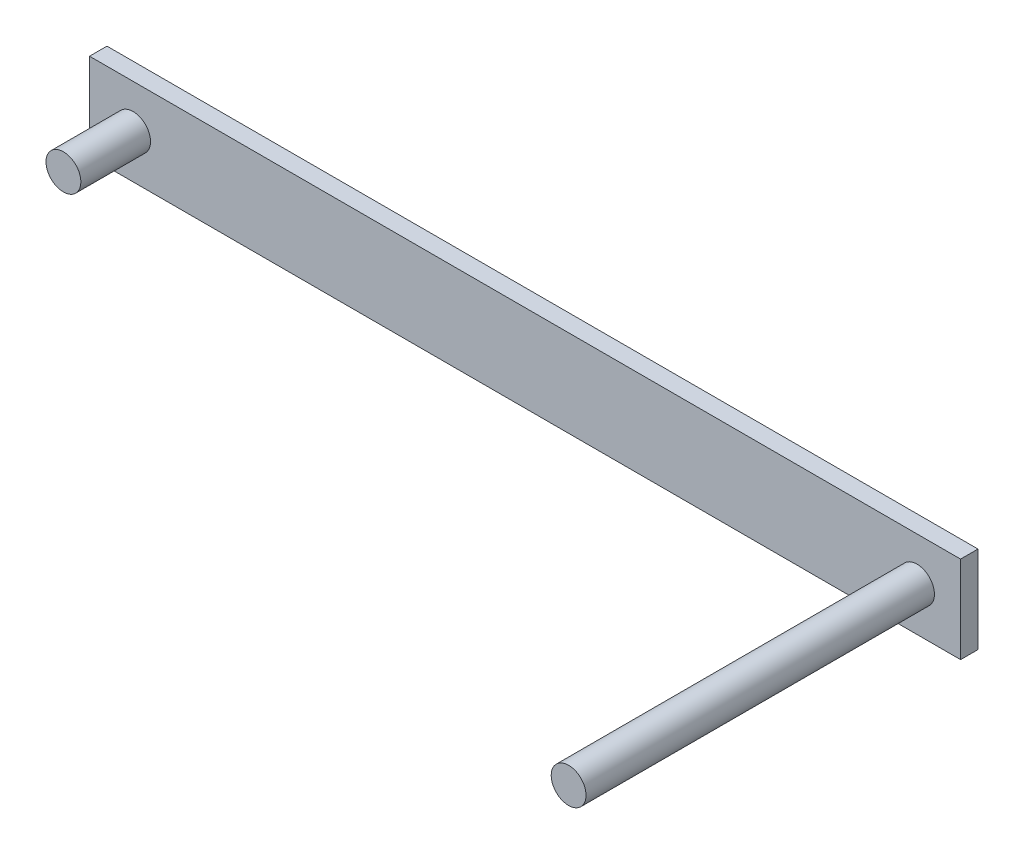
ISO-10303-21;
HEADER;
FILE_DESCRIPTION(('STEP AP214'),'2;1');
FILE_NAME('part.step','',(''),(''),'','','');
FILE_SCHEMA(('AUTOMOTIVE_DESIGN { 1 0 10303 214 1 1 1 1 }'));
ENDSEC;
DATA;
#1=APPLICATION_CONTEXT('core data for automotive mechanical design processes');
#2=APPLICATION_PROTOCOL_DEFINITION('international standard','automotive_design',2000,#1);
#3=PRODUCT_CONTEXT('',#1,'mechanical');
#4=PRODUCT('Part','Part','',(#3));
#5=PRODUCT_RELATED_PRODUCT_CATEGORY('part','',(#4));
#6=PRODUCT_DEFINITION_FORMATION('','',#4);
#7=PRODUCT_DEFINITION_CONTEXT('part definition',#1,'design');
#8=PRODUCT_DEFINITION('design','',#6,#7);
#9=PRODUCT_DEFINITION_SHAPE('','',#8);
#10=(LENGTH_UNIT() NAMED_UNIT(*) SI_UNIT(.MILLI.,.METRE.));
#11=(NAMED_UNIT(*) PLANE_ANGLE_UNIT() SI_UNIT($,.RADIAN.));
#12=(NAMED_UNIT(*) SI_UNIT($,.STERADIAN.) SOLID_ANGLE_UNIT());
#13=UNCERTAINTY_MEASURE_WITH_UNIT(LENGTH_MEASURE(1.E-05),#10,'distance_accuracy_value','');
#14=(GEOMETRIC_REPRESENTATION_CONTEXT(3) GLOBAL_UNCERTAINTY_ASSIGNED_CONTEXT((#13)) GLOBAL_UNIT_ASSIGNED_CONTEXT((#10,
#11,#12)) REPRESENTATION_CONTEXT('',''));
#15=CARTESIAN_POINT('',(0.,0.,0.));
#16=DIRECTION('',(0.,0.,1.));
#17=DIRECTION('',(1.,0.,0.));
#18=AXIS2_PLACEMENT_3D('',#15,#16,#17);
#19=CARTESIAN_POINT('',(0.,50.,10.));
#20=DIRECTION('',(0.,0.,-1.));
#21=DIRECTION('',(-1.,0.,0.));
#22=AXIS2_PLACEMENT_3D('',#19,#20,#21);
#23=PLANE('',#22);
#24=CARTESIAN_POINT('',(25.,25.,10.));
#25=DIRECTION('',(0.,0.,-1.));
#26=DIRECTION('',(-1.,0.,0.));
#27=AXIS2_PLACEMENT_3D('',#24,#25,#26);
#28=CIRCLE('',#27,10.);
#29=CARTESIAN_POINT('',(15.,25.,10.));
#30=VERTEX_POINT('',#29);
#31=EDGE_CURVE('E25',#30,#30,#28,.F.);
#32=ORIENTED_EDGE('',*,*,#31,.F.);
#33=EDGE_LOOP('',(#32));
#34=FACE_BOUND('',#33,.T.);
#35=DIRECTION('',(0.,-1.,0.));
#36=VECTOR('',#35,1.);
#37=CARTESIAN_POINT('',(0.,0.,10.));
#38=LINE('',#37,#36);
#39=CARTESIAN_POINT('',(0.,50.,10.));
#40=VERTEX_POINT('',#39);
#41=CARTESIAN_POINT('',(0.,0.,10.));
#42=VERTEX_POINT('',#41);
#43=EDGE_CURVE('E69',#40,#42,#38,.T.);
#44=ORIENTED_EDGE('',*,*,#43,.T.);
#45=DIRECTION('',(1.,0.,0.));
#46=VECTOR('',#45,1.);
#47=CARTESIAN_POINT('',(0.,0.,10.));
#48=LINE('',#47,#46);
#49=CARTESIAN_POINT('',(500.,0.,10.));
#50=VERTEX_POINT('',#49);
#51=EDGE_CURVE('E64',#42,#50,#48,.T.);
#52=ORIENTED_EDGE('',*,*,#51,.T.);
#53=DIRECTION('',(0.,1.,0.));
#54=VECTOR('',#53,1.);
#55=CARTESIAN_POINT('',(500.,0.,10.));
#56=LINE('',#55,#54);
#57=CARTESIAN_POINT('',(500.,50.,10.));
#58=VERTEX_POINT('',#57);
#59=EDGE_CURVE('E67',#50,#58,#56,.T.);
#60=ORIENTED_EDGE('',*,*,#59,.T.);
#61=DIRECTION('',(-1.,0.,0.));
#62=VECTOR('',#61,1.);
#63=CARTESIAN_POINT('',(0.,50.,10.));
#64=LINE('',#63,#62);
#65=EDGE_CURVE('E33',#58,#40,#64,.T.);
#66=ORIENTED_EDGE('',*,*,#65,.T.);
#67=EDGE_LOOP('',(#44,#52,#60,#66));
#68=FACE_BOUND('',#67,.T.);
#69=CARTESIAN_POINT('',(475.,25.,10.));
#70=DIRECTION('',(0.,0.,-1.));
#71=DIRECTION('',(-1.,0.,0.));
#72=AXIS2_PLACEMENT_3D('',#69,#70,#71);
#73=CIRCLE('',#72,10.);
#74=CARTESIAN_POINT('',(465.,25.,10.));
#75=VERTEX_POINT('',#74);
#76=EDGE_CURVE('E11',#75,#75,#73,.F.);
#77=ORIENTED_EDGE('',*,*,#76,.F.);
#78=EDGE_LOOP('',(#77));
#79=FACE_BOUND('',#78,.T.);
#80=ADVANCED_FACE('F16',(#34,#68,#79),#23,.F.);
#81=CARTESIAN_POINT('',(0.,0.,10.));
#82=DIRECTION('',(1.,0.,0.));
#83=DIRECTION('',(0.,0.,-1.));
#84=AXIS2_PLACEMENT_3D('',#81,#82,#83);
#85=PLANE('',#84);
#86=DIRECTION('',(0.,-1.,0.));
#87=VECTOR('',#86,1.);
#88=CARTESIAN_POINT('',(0.,0.,0.));
#89=LINE('',#88,#87);
#90=CARTESIAN_POINT('',(0.,50.,0.));
#91=VERTEX_POINT('',#90);
#92=CARTESIAN_POINT('',(0.,0.,0.));
#93=VERTEX_POINT('',#92);
#94=EDGE_CURVE('E84',#91,#93,#89,.T.);
#95=ORIENTED_EDGE('',*,*,#94,.T.);
#96=DIRECTION('',(0.,0.,-1.));
#97=VECTOR('',#96,1.);
#98=CARTESIAN_POINT('',(0.,0.,10.));
#99=LINE('',#98,#97);
#100=EDGE_CURVE('E75',#42,#93,#99,.T.);
#101=ORIENTED_EDGE('',*,*,#100,.F.);
#102=ORIENTED_EDGE('',*,*,#43,.F.);
#103=DIRECTION('',(0.,0.,-1.));
#104=VECTOR('',#103,1.);
#105=CARTESIAN_POINT('',(0.,50.,10.));
#106=LINE('',#105,#104);
#107=EDGE_CURVE('E80',#40,#91,#106,.T.);
#108=ORIENTED_EDGE('',*,*,#107,.T.);
#109=EDGE_LOOP('',(#95,#101,#102,#108));
#110=FACE_BOUND('',#109,.T.);
#111=ADVANCED_FACE('F18',(#110),#85,.F.);
#112=CARTESIAN_POINT('',(0.,0.,10.));
#113=DIRECTION('',(0.,1.,0.));
#114=DIRECTION('',(0.,0.,1.));
#115=AXIS2_PLACEMENT_3D('',#112,#113,#114);
#116=PLANE('',#115);
#117=DIRECTION('',(1.,0.,0.));
#118=VECTOR('',#117,1.);
#119=CARTESIAN_POINT('',(0.,0.,0.));
#120=LINE('',#119,#118);
#121=CARTESIAN_POINT('',(500.,0.,0.));
#122=VERTEX_POINT('',#121);
#123=EDGE_CURVE('E74',#93,#122,#120,.T.);
#124=ORIENTED_EDGE('',*,*,#123,.T.);
#125=DIRECTION('',(0.,0.,-1.));
#126=VECTOR('',#125,1.);
#127=CARTESIAN_POINT('',(500.,0.,10.));
#128=LINE('',#127,#126);
#129=EDGE_CURVE('E72',#50,#122,#128,.T.);
#130=ORIENTED_EDGE('',*,*,#129,.F.);
#131=ORIENTED_EDGE('',*,*,#51,.F.);
#132=ORIENTED_EDGE('',*,*,#100,.T.);
#133=EDGE_LOOP('',(#124,#130,#131,#132));
#134=FACE_BOUND('',#133,.T.);
#135=ADVANCED_FACE('F73',(#134),#116,.F.);
#136=CARTESIAN_POINT('',(500.,0.,10.));
#137=DIRECTION('',(-1.,0.,0.));
#138=DIRECTION('',(0.,0.,1.));
#139=AXIS2_PLACEMENT_3D('',#136,#137,#138);
#140=PLANE('',#139);
#141=DIRECTION('',(0.,1.,0.));
#142=VECTOR('',#141,1.);
#143=CARTESIAN_POINT('',(500.,0.,0.));
#144=LINE('',#143,#142);
#145=CARTESIAN_POINT('',(500.,50.,0.));
#146=VERTEX_POINT('',#145);
#147=EDGE_CURVE('E50',#122,#146,#144,.T.);
#148=ORIENTED_EDGE('',*,*,#147,.T.);
#149=DIRECTION('',(0.,0.,-1.));
#150=VECTOR('',#149,1.);
#151=CARTESIAN_POINT('',(500.,50.,10.));
#152=LINE('',#151,#150);
#153=EDGE_CURVE('E76',#58,#146,#152,.T.);
#154=ORIENTED_EDGE('',*,*,#153,.F.);
#155=ORIENTED_EDGE('',*,*,#59,.F.);
#156=ORIENTED_EDGE('',*,*,#129,.T.);
#157=EDGE_LOOP('',(#148,#154,#155,#156));
#158=FACE_BOUND('',#157,.T.);
#159=ADVANCED_FACE('F78',(#158),#140,.F.);
#160=CARTESIAN_POINT('',(0.,50.,10.));
#161=DIRECTION('',(0.,-1.,0.));
#162=DIRECTION('',(0.,0.,-1.));
#163=AXIS2_PLACEMENT_3D('',#160,#161,#162);
#164=PLANE('',#163);
#165=DIRECTION('',(-1.,0.,0.));
#166=VECTOR('',#165,1.);
#167=CARTESIAN_POINT('',(0.,50.,0.));
#168=LINE('',#167,#166);
#169=EDGE_CURVE('E56',#146,#91,#168,.T.);
#170=ORIENTED_EDGE('',*,*,#169,.T.);
#171=ORIENTED_EDGE('',*,*,#107,.F.);
#172=ORIENTED_EDGE('',*,*,#65,.F.);
#173=ORIENTED_EDGE('',*,*,#153,.T.);
#174=EDGE_LOOP('',(#170,#171,#172,#173));
#175=FACE_BOUND('',#174,.T.);
#176=ADVANCED_FACE('F112',(#175),#164,.F.);
#177=CARTESIAN_POINT('',(0.,50.,0.));
#178=DIRECTION('',(0.,0.,-1.));
#179=DIRECTION('',(-1.,0.,0.));
#180=AXIS2_PLACEMENT_3D('',#177,#178,#179);
#181=PLANE('',#180);
#182=ORIENTED_EDGE('',*,*,#94,.F.);
#183=ORIENTED_EDGE('',*,*,#169,.F.);
#184=ORIENTED_EDGE('',*,*,#147,.F.);
#185=ORIENTED_EDGE('',*,*,#123,.F.);
#186=EDGE_LOOP('',(#182,#183,#184,#185));
#187=FACE_BOUND('',#186,.T.);
#188=ADVANCED_FACE('F109',(#187),#181,.T.);
#189=CARTESIAN_POINT('',(25.,25.,50.));
#190=DIRECTION('',(0.,0.,-1.));
#191=DIRECTION('',(-1.,0.,0.));
#192=AXIS2_PLACEMENT_3D('',#189,#190,#191);
#193=CYLINDRICAL_SURFACE('',#192,10.);
#194=CARTESIAN_POINT('',(25.,25.,50.));
#195=DIRECTION('',(0.,0.,1.));
#196=DIRECTION('',(1.,0.,0.));
#197=AXIS2_PLACEMENT_3D('',#194,#195,#196);
#198=CIRCLE('',#197,10.);
#199=CARTESIAN_POINT('',(35.,25.,50.));
#200=VERTEX_POINT('',#199);
#201=EDGE_CURVE('E87',#200,#200,#198,.T.);
#202=ORIENTED_EDGE('',*,*,#201,.F.);
#203=EDGE_LOOP('',(#202));
#204=FACE_BOUND('',#203,.T.);
#205=ORIENTED_EDGE('',*,*,#31,.T.);
#206=EDGE_LOOP('',(#205));
#207=FACE_BOUND('',#206,.T.);
#208=ADVANCED_FACE('F96',(#204,#207),#193,.T.);
#209=CARTESIAN_POINT('',(250.,-365.989857453915,50.));
#210=DIRECTION('',(0.,0.,1.));
#211=DIRECTION('',(1.,0.,0.));
#212=AXIS2_PLACEMENT_3D('',#209,#210,#211);
#213=PLANE('',#212);
#214=ORIENTED_EDGE('',*,*,#201,.T.);
#215=EDGE_LOOP('',(#214));
#216=FACE_BOUND('',#215,.T.);
#217=ADVANCED_FACE('F149',(#216),#213,.T.);
#218=CARTESIAN_POINT('',(475.,25.,210.));
#219=DIRECTION('',(0.,0.,-1.));
#220=DIRECTION('',(-1.,0.,0.));
#221=AXIS2_PLACEMENT_3D('',#218,#219,#220);
#222=CYLINDRICAL_SURFACE('',#221,10.);
#223=CARTESIAN_POINT('',(475.,25.,210.));
#224=DIRECTION('',(0.,0.,1.));
#225=DIRECTION('',(1.,0.,0.));
#226=AXIS2_PLACEMENT_3D('',#223,#224,#225);
#227=CIRCLE('',#226,10.);
#228=CARTESIAN_POINT('',(485.,25.,210.));
#229=VERTEX_POINT('',#228);
#230=EDGE_CURVE('E197',#229,#229,#227,.T.);
#231=ORIENTED_EDGE('',*,*,#230,.F.);
#232=EDGE_LOOP('',(#231));
#233=FACE_BOUND('',#232,.T.);
#234=ORIENTED_EDGE('',*,*,#76,.T.);
#235=EDGE_LOOP('',(#234));
#236=FACE_BOUND('',#235,.T.);
#237=ADVANCED_FACE('F157',(#233,#236),#222,.T.);
#238=CARTESIAN_POINT('',(250.,-365.989857453915,210.));
#239=DIRECTION('',(0.,0.,1.));
#240=DIRECTION('',(1.,0.,0.));
#241=AXIS2_PLACEMENT_3D('',#238,#239,#240);
#242=PLANE('',#241);
#243=ORIENTED_EDGE('',*,*,#230,.T.);
#244=EDGE_LOOP('',(#243));
#245=FACE_BOUND('',#244,.T.);
#246=ADVANCED_FACE('F165',(#245),#242,.T.);
#247=CLOSED_SHELL('',(#80,#111,#135,#159,#176,#188,#208,#217,#237,#246));
#248=MANIFOLD_SOLID_BREP('B1',#247);
#249=ADVANCED_BREP_SHAPE_REPRESENTATION('',(#18,#248),#14);
#250=SHAPE_DEFINITION_REPRESENTATION(#9,#249);
ENDSEC;
END-ISO-10303-21;
